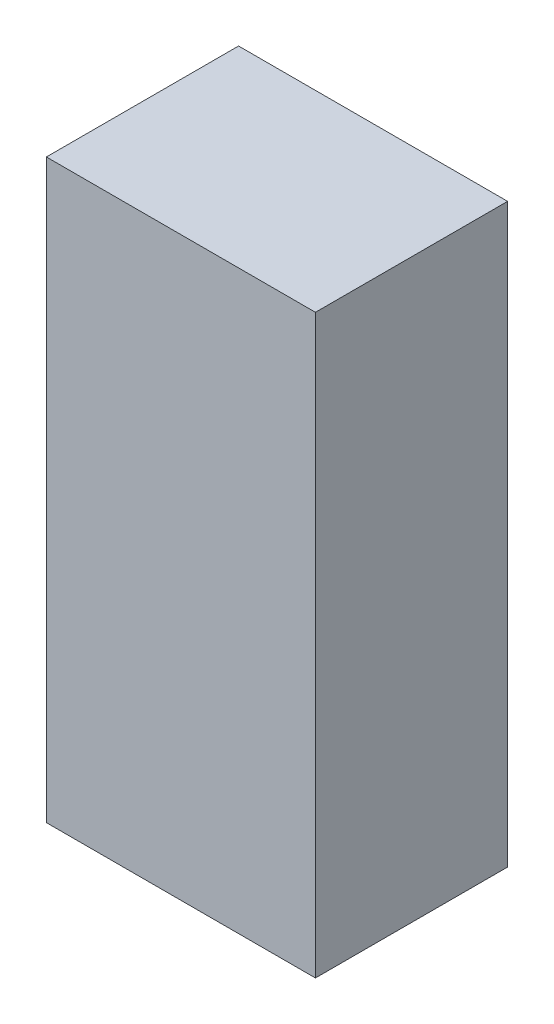
ISO-10303-21;
HEADER;
FILE_DESCRIPTION(('STEP AP214'),'2;1');
FILE_NAME('part.step','',(''),(''),'','','');
FILE_SCHEMA(('AUTOMOTIVE_DESIGN { 1 0 10303 214 1 1 1 1 }'));
ENDSEC;
DATA;
#1=APPLICATION_CONTEXT('core data for automotive mechanical design processes');
#2=APPLICATION_PROTOCOL_DEFINITION('international standard','automotive_design',2000,#1);
#3=PRODUCT_CONTEXT('',#1,'mechanical');
#4=PRODUCT('Part','Part','',(#3));
#5=PRODUCT_RELATED_PRODUCT_CATEGORY('part','',(#4));
#6=PRODUCT_DEFINITION_FORMATION('','',#4);
#7=PRODUCT_DEFINITION_CONTEXT('part definition',#1,'design');
#8=PRODUCT_DEFINITION('design','',#6,#7);
#9=PRODUCT_DEFINITION_SHAPE('','',#8);
#10=(LENGTH_UNIT() NAMED_UNIT(*) SI_UNIT(.MILLI.,.METRE.));
#11=(NAMED_UNIT(*) PLANE_ANGLE_UNIT() SI_UNIT($,.RADIAN.));
#12=(NAMED_UNIT(*) SI_UNIT($,.STERADIAN.) SOLID_ANGLE_UNIT());
#13=UNCERTAINTY_MEASURE_WITH_UNIT(LENGTH_MEASURE(1.E-05),#10,'distance_accuracy_value','');
#14=(GEOMETRIC_REPRESENTATION_CONTEXT(3) GLOBAL_UNCERTAINTY_ASSIGNED_CONTEXT((#13)) GLOBAL_UNIT_ASSIGNED_CONTEXT((#10,
#11,#12)) REPRESENTATION_CONTEXT('',''));
#15=CARTESIAN_POINT('',(0.,0.,0.));
#16=DIRECTION('',(0.,0.,1.));
#17=DIRECTION('',(1.,0.,0.));
#18=AXIS2_PLACEMENT_3D('',#15,#16,#17);
#19=CARTESIAN_POINT('',(-0.6999986,1.49999954,0.));
#20=DIRECTION('',(1.,0.,0.));
#21=DIRECTION('',(0.,-1.,0.));
#22=AXIS2_PLACEMENT_3D('',#19,#20,#21);
#23=PLANE('',#22);
#24=DIRECTION('',(0.,-1.,0.));
#25=VECTOR('',#24,1.);
#26=CARTESIAN_POINT('',(-0.6999986,1.49999954,0.));
#27=LINE('',#26,#25);
#28=CARTESIAN_POINT('',(-0.6999986,1.49999954,0.));
#29=VERTEX_POINT('',#28);
#30=CARTESIAN_POINT('',(-0.6999986,-1.49999954,0.));
#31=VERTEX_POINT('',#30);
#32=EDGE_CURVE('E11',#29,#31,#27,.T.);
#33=ORIENTED_EDGE('',*,*,#32,.T.);
#34=DIRECTION('',(0.,0.,1.));
#35=VECTOR('',#34,1.);
#36=CARTESIAN_POINT('',(-0.6999986,-1.49999954,0.));
#37=LINE('',#36,#35);
#38=CARTESIAN_POINT('',(-0.6999986,-1.49999954,1.00000054));
#39=VERTEX_POINT('',#38);
#40=EDGE_CURVE('E23',#31,#39,#37,.T.);
#41=ORIENTED_EDGE('',*,*,#40,.T.);
#42=DIRECTION('',(0.,-1.,0.));
#43=VECTOR('',#42,1.);
#44=CARTESIAN_POINT('',(-0.6999986,1.49999954,1.00000054));
#45=LINE('',#44,#43);
#46=CARTESIAN_POINT('',(-0.6999986,1.49999954,1.00000054));
#47=VERTEX_POINT('',#46);
#48=EDGE_CURVE('E86',#47,#39,#45,.T.);
#49=ORIENTED_EDGE('',*,*,#48,.F.);
#50=DIRECTION('',(0.,0.,1.));
#51=VECTOR('',#50,1.);
#52=CARTESIAN_POINT('',(-0.6999986,1.49999954,0.));
#53=LINE('',#52,#51);
#54=EDGE_CURVE('E35',#29,#47,#53,.T.);
#55=ORIENTED_EDGE('',*,*,#54,.F.);
#56=EDGE_LOOP('',(#33,#41,#49,#55));
#57=FACE_BOUND('',#56,.T.);
#58=ADVANCED_FACE('F16',(#57),#23,.F.);
#59=CARTESIAN_POINT('',(-0.6999986,-1.49999954,0.));
#60=DIRECTION('',(0.,1.,0.));
#61=DIRECTION('',(1.,0.,0.));
#62=AXIS2_PLACEMENT_3D('',#59,#60,#61);
#63=PLANE('',#62);
#64=DIRECTION('',(1.,0.,0.));
#65=VECTOR('',#64,1.);
#66=CARTESIAN_POINT('',(-0.6999986,-1.49999954,0.));
#67=LINE('',#66,#65);
#68=CARTESIAN_POINT('',(0.70000114,-1.49999954,0.));
#69=VERTEX_POINT('',#68);
#70=EDGE_CURVE('E83',#31,#69,#67,.T.);
#71=ORIENTED_EDGE('',*,*,#70,.T.);
#72=DIRECTION('',(0.,0.,1.));
#73=VECTOR('',#72,1.);
#74=CARTESIAN_POINT('',(0.70000114,-1.49999954,0.));
#75=LINE('',#74,#73);
#76=CARTESIAN_POINT('',(0.70000114,-1.49999954,1.00000054));
#77=VERTEX_POINT('',#76);
#78=EDGE_CURVE('E81',#69,#77,#75,.T.);
#79=ORIENTED_EDGE('',*,*,#78,.T.);
#80=DIRECTION('',(1.,0.,0.));
#81=VECTOR('',#80,1.);
#82=CARTESIAN_POINT('',(-0.6999986,-1.49999954,1.00000054));
#83=LINE('',#82,#81);
#84=EDGE_CURVE('E61',#39,#77,#83,.T.);
#85=ORIENTED_EDGE('',*,*,#84,.F.);
#86=ORIENTED_EDGE('',*,*,#40,.F.);
#87=EDGE_LOOP('',(#71,#79,#85,#86));
#88=FACE_BOUND('',#87,.T.);
#89=ADVANCED_FACE('F88',(#88),#63,.F.);
#90=CARTESIAN_POINT('',(0.70000114,-1.49999954,0.));
#91=DIRECTION('',(-1.,0.,0.));
#92=DIRECTION('',(0.,1.,0.));
#93=AXIS2_PLACEMENT_3D('',#90,#91,#92);
#94=PLANE('',#93);
#95=DIRECTION('',(0.,1.,0.));
#96=VECTOR('',#95,1.);
#97=CARTESIAN_POINT('',(0.70000114,-1.49999954,0.));
#98=LINE('',#97,#96);
#99=CARTESIAN_POINT('',(0.70000114,1.49999954,0.));
#100=VERTEX_POINT('',#99);
#101=EDGE_CURVE('E70',#69,#100,#98,.T.);
#102=ORIENTED_EDGE('',*,*,#101,.T.);
#103=DIRECTION('',(0.,0.,1.));
#104=VECTOR('',#103,1.);
#105=CARTESIAN_POINT('',(0.70000114,1.49999954,0.));
#106=LINE('',#105,#104);
#107=CARTESIAN_POINT('',(0.70000114,1.49999954,1.00000054));
#108=VERTEX_POINT('',#107);
#109=EDGE_CURVE('E64',#100,#108,#106,.T.);
#110=ORIENTED_EDGE('',*,*,#109,.T.);
#111=DIRECTION('',(0.,1.,0.));
#112=VECTOR('',#111,1.);
#113=CARTESIAN_POINT('',(0.70000114,-1.49999954,1.00000054));
#114=LINE('',#113,#112);
#115=EDGE_CURVE('E56',#77,#108,#114,.T.);
#116=ORIENTED_EDGE('',*,*,#115,.F.);
#117=ORIENTED_EDGE('',*,*,#78,.F.);
#118=EDGE_LOOP('',(#102,#110,#116,#117));
#119=FACE_BOUND('',#118,.T.);
#120=ADVANCED_FACE('F68',(#119),#94,.F.);
#121=CARTESIAN_POINT('',(0.70000114,1.49999954,0.));
#122=DIRECTION('',(0.,-1.,0.));
#123=DIRECTION('',(-1.,0.,0.));
#124=AXIS2_PLACEMENT_3D('',#121,#122,#123);
#125=PLANE('',#124);
#126=DIRECTION('',(-1.,0.,0.));
#127=VECTOR('',#126,1.);
#128=CARTESIAN_POINT('',(0.70000114,1.49999954,0.));
#129=LINE('',#128,#127);
#130=EDGE_CURVE('E65',#100,#29,#129,.T.);
#131=ORIENTED_EDGE('',*,*,#130,.T.);
#132=ORIENTED_EDGE('',*,*,#54,.T.);
#133=DIRECTION('',(-1.,0.,0.));
#134=VECTOR('',#133,1.);
#135=CARTESIAN_POINT('',(0.70000114,1.49999954,1.00000054));
#136=LINE('',#135,#134);
#137=EDGE_CURVE('E60',#108,#47,#136,.T.);
#138=ORIENTED_EDGE('',*,*,#137,.F.);
#139=ORIENTED_EDGE('',*,*,#109,.F.);
#140=EDGE_LOOP('',(#131,#132,#138,#139));
#141=FACE_BOUND('',#140,.T.);
#142=ADVANCED_FACE('F75',(#141),#125,.F.);
#143=CARTESIAN_POINT('',(-0.6999986,1.49999954,0.));
#144=DIRECTION('',(0.,0.,-1.));
#145=DIRECTION('',(-1.,0.,0.));
#146=AXIS2_PLACEMENT_3D('',#143,#144,#145);
#147=PLANE('',#146);
#148=ORIENTED_EDGE('',*,*,#130,.F.);
#149=ORIENTED_EDGE('',*,*,#101,.F.);
#150=ORIENTED_EDGE('',*,*,#70,.F.);
#151=ORIENTED_EDGE('',*,*,#32,.F.);
#152=EDGE_LOOP('',(#148,#149,#150,#151));
#153=FACE_BOUND('',#152,.T.);
#154=ADVANCED_FACE('F90',(#153),#147,.T.);
#155=CARTESIAN_POINT('',(-0.6999986,1.49999954,1.00000054));
#156=DIRECTION('',(0.,0.,-1.));
#157=DIRECTION('',(-1.,0.,0.));
#158=AXIS2_PLACEMENT_3D('',#155,#156,#157);
#159=PLANE('',#158);
#160=ORIENTED_EDGE('',*,*,#48,.T.);
#161=ORIENTED_EDGE('',*,*,#84,.T.);
#162=ORIENTED_EDGE('',*,*,#115,.T.);
#163=ORIENTED_EDGE('',*,*,#137,.T.);
#164=EDGE_LOOP('',(#160,#161,#162,#163));
#165=FACE_BOUND('',#164,.T.);
#166=ADVANCED_FACE('F58',(#165),#159,.F.);
#167=CLOSED_SHELL('',(#58,#89,#120,#142,#154,#166));
#168=MANIFOLD_SOLID_BREP('B1',#167);
#169=ADVANCED_BREP_SHAPE_REPRESENTATION('',(#18,#168),#14);
#170=SHAPE_DEFINITION_REPRESENTATION(#9,#169);
ENDSEC;
END-ISO-10303-21;
